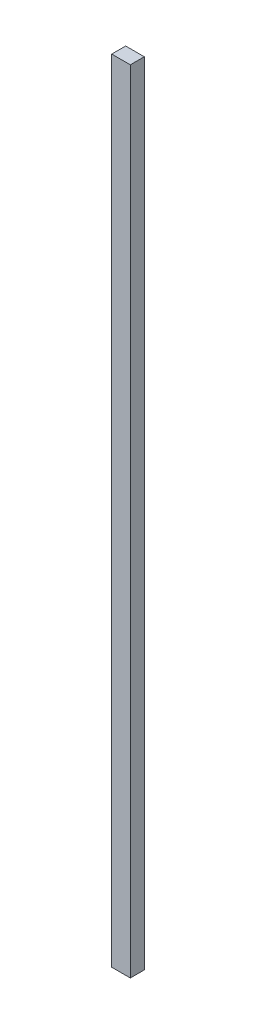
ISO-10303-21;
HEADER;
FILE_DESCRIPTION(('STEP AP214'),'2;1');
FILE_NAME('part.step','',(''),(''),'','','');
FILE_SCHEMA(('AUTOMOTIVE_DESIGN { 1 0 10303 214 1 1 1 1 }'));
ENDSEC;
DATA;
#1=APPLICATION_CONTEXT('core data for automotive mechanical design processes');
#2=APPLICATION_PROTOCOL_DEFINITION('international standard','automotive_design',2000,#1);
#3=PRODUCT_CONTEXT('',#1,'mechanical');
#4=PRODUCT('Part','Part','',(#3));
#5=PRODUCT_RELATED_PRODUCT_CATEGORY('part','',(#4));
#6=PRODUCT_DEFINITION_FORMATION('','',#4);
#7=PRODUCT_DEFINITION_CONTEXT('part definition',#1,'design');
#8=PRODUCT_DEFINITION('design','',#6,#7);
#9=PRODUCT_DEFINITION_SHAPE('','',#8);
#10=(LENGTH_UNIT() NAMED_UNIT(*) SI_UNIT(.MILLI.,.METRE.));
#11=(NAMED_UNIT(*) PLANE_ANGLE_UNIT() SI_UNIT($,.RADIAN.));
#12=(NAMED_UNIT(*) SI_UNIT($,.STERADIAN.) SOLID_ANGLE_UNIT());
#13=UNCERTAINTY_MEASURE_WITH_UNIT(LENGTH_MEASURE(1.E-05),#10,'distance_accuracy_value','');
#14=(GEOMETRIC_REPRESENTATION_CONTEXT(3) GLOBAL_UNCERTAINTY_ASSIGNED_CONTEXT((#13)) GLOBAL_UNIT_ASSIGNED_CONTEXT((#10,
#11,#12)) REPRESENTATION_CONTEXT('',''));
#15=CARTESIAN_POINT('',(0.,0.,0.));
#16=DIRECTION('',(0.,0.,1.));
#17=DIRECTION('',(1.,0.,0.));
#18=AXIS2_PLACEMENT_3D('',#15,#16,#17);
#19=CARTESIAN_POINT('',(63.,19.2344470187935,535.254219734892));
#20=DIRECTION('',(0.,1.,0.));
#21=DIRECTION('',(0.,0.,1.));
#22=AXIS2_PLACEMENT_3D('',#19,#20,#21);
#23=PLANE('',#22);
#24=DIRECTION('',(-1.,0.,0.));
#25=VECTOR('',#24,1.);
#26=CARTESIAN_POINT('',(63.,19.2344470187935,539.754219734892));
#27=LINE('',#26,#25);
#28=CARTESIAN_POINT('',(63.,19.2344470187935,539.754219734892));
#29=VERTEX_POINT('',#28);
#30=CARTESIAN_POINT('',(57.,19.2344470187935,539.754219734892));
#31=VERTEX_POINT('',#30);
#32=EDGE_CURVE('E86',#29,#31,#27,.T.);
#33=ORIENTED_EDGE('',*,*,#32,.T.);
#34=DIRECTION('',(0.,0.,1.));
#35=VECTOR('',#34,1.);
#36=CARTESIAN_POINT('',(57.,19.2344470187935,535.254219734892));
#37=LINE('',#36,#35);
#38=CARTESIAN_POINT('',(57.,19.2344470187935,535.254219734892));
#39=VERTEX_POINT('',#38);
#40=EDGE_CURVE('E40',#39,#31,#37,.T.);
#41=ORIENTED_EDGE('',*,*,#40,.F.);
#42=DIRECTION('',(-1.,0.,0.));
#43=VECTOR('',#42,1.);
#44=CARTESIAN_POINT('',(63.,19.2344470187935,535.254219734892));
#45=LINE('',#44,#43);
#46=CARTESIAN_POINT('',(63.,19.2344470187935,535.254219734892));
#47=VERTEX_POINT('',#46);
#48=EDGE_CURVE('E77',#47,#39,#45,.T.);
#49=ORIENTED_EDGE('',*,*,#48,.F.);
#50=DIRECTION('',(0.,0.,1.));
#51=VECTOR('',#50,1.);
#52=CARTESIAN_POINT('',(63.,19.2344470187935,535.254219734892));
#53=LINE('',#52,#51);
#54=EDGE_CURVE('E11',#47,#29,#53,.T.);
#55=ORIENTED_EDGE('',*,*,#54,.T.);
#56=EDGE_LOOP('',(#33,#41,#49,#55));
#57=FACE_BOUND('',#56,.T.);
#58=ADVANCED_FACE('F32',(#57),#23,.F.);
#59=CARTESIAN_POINT('',(57.,199.234447018794,535.254219734892));
#60=DIRECTION('',(1.,0.,0.));
#61=DIRECTION('',(0.,0.,-1.));
#62=AXIS2_PLACEMENT_3D('',#59,#60,#61);
#63=PLANE('',#62);
#64=DIRECTION('',(0.,1.,0.));
#65=VECTOR('',#64,1.);
#66=CARTESIAN_POINT('',(57.,199.234447018794,539.754219734892));
#67=LINE('',#66,#65);
#68=CARTESIAN_POINT('',(57.,274.234447018794,539.754219734892));
#69=VERTEX_POINT('',#68);
#70=EDGE_CURVE('E65',#31,#69,#67,.T.);
#71=ORIENTED_EDGE('',*,*,#70,.T.);
#72=DIRECTION('',(0.,0.,1.));
#73=VECTOR('',#72,1.);
#74=CARTESIAN_POINT('',(57.,274.234447018794,535.254219734892));
#75=LINE('',#74,#73);
#76=CARTESIAN_POINT('',(57.,274.234447018794,535.254219734892));
#77=VERTEX_POINT('',#76);
#78=EDGE_CURVE('E87',#77,#69,#75,.T.);
#79=ORIENTED_EDGE('',*,*,#78,.F.);
#80=DIRECTION('',(0.,1.,0.));
#81=VECTOR('',#80,1.);
#82=CARTESIAN_POINT('',(57.,19.2344470187935,535.254219734892));
#83=LINE('',#82,#81);
#84=EDGE_CURVE('E81',#39,#77,#83,.T.);
#85=ORIENTED_EDGE('',*,*,#84,.F.);
#86=ORIENTED_EDGE('',*,*,#40,.T.);
#87=EDGE_LOOP('',(#71,#79,#85,#86));
#88=FACE_BOUND('',#87,.T.);
#89=ADVANCED_FACE('F88',(#88),#63,.F.);
#90=CARTESIAN_POINT('',(57.,274.234447018794,535.254219734892));
#91=DIRECTION('',(0.,-1.,0.));
#92=DIRECTION('',(0.,0.,-1.));
#93=AXIS2_PLACEMENT_3D('',#90,#91,#92);
#94=PLANE('',#93);
#95=DIRECTION('',(1.,0.,0.));
#96=VECTOR('',#95,1.);
#97=CARTESIAN_POINT('',(57.,274.234447018794,539.754219734892));
#98=LINE('',#97,#96);
#99=CARTESIAN_POINT('',(63.,274.234447018794,539.754219734892));
#100=VERTEX_POINT('',#99);
#101=EDGE_CURVE('E72',#69,#100,#98,.T.);
#102=ORIENTED_EDGE('',*,*,#101,.T.);
#103=DIRECTION('',(0.,0.,1.));
#104=VECTOR('',#103,1.);
#105=CARTESIAN_POINT('',(63.,274.234447018794,535.254219734892));
#106=LINE('',#105,#104);
#107=CARTESIAN_POINT('',(63.,274.234447018794,535.254219734892));
#108=VERTEX_POINT('',#107);
#109=EDGE_CURVE('E92',#108,#100,#106,.T.);
#110=ORIENTED_EDGE('',*,*,#109,.F.);
#111=DIRECTION('',(1.,0.,0.));
#112=VECTOR('',#111,1.);
#113=CARTESIAN_POINT('',(57.,274.234447018794,535.254219734892));
#114=LINE('',#113,#112);
#115=EDGE_CURVE('E90',#77,#108,#114,.T.);
#116=ORIENTED_EDGE('',*,*,#115,.F.);
#117=ORIENTED_EDGE('',*,*,#78,.T.);
#118=EDGE_LOOP('',(#102,#110,#116,#117));
#119=FACE_BOUND('',#118,.T.);
#120=ADVANCED_FACE('F102',(#119),#94,.F.);
#121=CARTESIAN_POINT('',(63.,199.234447018794,535.254219734892));
#122=DIRECTION('',(-1.,0.,0.));
#123=DIRECTION('',(0.,-1.,0.));
#124=AXIS2_PLACEMENT_3D('',#121,#122,#123);
#125=PLANE('',#124);
#126=DIRECTION('',(0.,-1.,0.));
#127=VECTOR('',#126,1.);
#128=CARTESIAN_POINT('',(63.,199.234447018794,539.754219734892));
#129=LINE('',#128,#127);
#130=EDGE_CURVE('E99',#100,#29,#129,.T.);
#131=ORIENTED_EDGE('',*,*,#130,.T.);
#132=ORIENTED_EDGE('',*,*,#54,.F.);
#133=DIRECTION('',(0.,-1.,0.));
#134=VECTOR('',#133,1.);
#135=CARTESIAN_POINT('',(63.,199.234447018794,535.254219734892));
#136=LINE('',#135,#134);
#137=EDGE_CURVE('E48',#108,#47,#136,.T.);
#138=ORIENTED_EDGE('',*,*,#137,.F.);
#139=ORIENTED_EDGE('',*,*,#109,.T.);
#140=EDGE_LOOP('',(#131,#132,#138,#139));
#141=FACE_BOUND('',#140,.T.);
#142=ADVANCED_FACE('F106',(#141),#125,.F.);
#143=CARTESIAN_POINT('',(51.,124.724279965975,535.254219734892));
#144=DIRECTION('',(0.,0.,-1.));
#145=DIRECTION('',(-1.,0.,0.));
#146=AXIS2_PLACEMENT_3D('',#143,#144,#145);
#147=PLANE('',#146);
#148=ORIENTED_EDGE('',*,*,#137,.T.);
#149=ORIENTED_EDGE('',*,*,#48,.T.);
#150=ORIENTED_EDGE('',*,*,#84,.T.);
#151=ORIENTED_EDGE('',*,*,#115,.T.);
#152=EDGE_LOOP('',(#148,#149,#150,#151));
#153=FACE_BOUND('',#152,.T.);
#154=ADVANCED_FACE('F79',(#153),#147,.T.);
#155=CARTESIAN_POINT('',(51.,124.724279965975,539.754219734892));
#156=DIRECTION('',(0.,0.,-1.));
#157=DIRECTION('',(-1.,0.,0.));
#158=AXIS2_PLACEMENT_3D('',#155,#156,#157);
#159=PLANE('',#158);
#160=ORIENTED_EDGE('',*,*,#32,.F.);
#161=ORIENTED_EDGE('',*,*,#130,.F.);
#162=ORIENTED_EDGE('',*,*,#101,.F.);
#163=ORIENTED_EDGE('',*,*,#70,.F.);
#164=EDGE_LOOP('',(#160,#161,#162,#163));
#165=FACE_BOUND('',#164,.T.);
#166=ADVANCED_FACE('F105',(#165),#159,.F.);
#167=CLOSED_SHELL('',(#58,#89,#120,#142,#154,#166));
#168=MANIFOLD_SOLID_BREP('B2',#167);
#169=ADVANCED_BREP_SHAPE_REPRESENTATION('',(#18,#168),#14);
#170=SHAPE_DEFINITION_REPRESENTATION(#9,#169);
ENDSEC;
END-ISO-10303-21;
